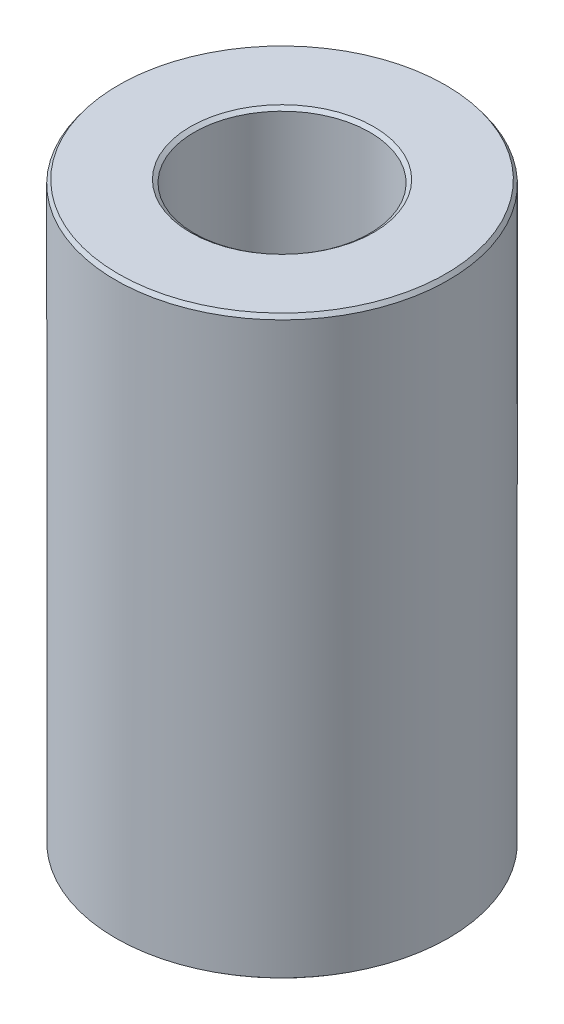
ISO-10303-21;
HEADER;
FILE_DESCRIPTION(('STEP AP214'),'2;1');
FILE_NAME('part.step','',(''),(''),'','','');
FILE_SCHEMA(('AUTOMOTIVE_DESIGN { 1 0 10303 214 1 1 1 1 }'));
ENDSEC;
DATA;
#1=APPLICATION_CONTEXT('core data for automotive mechanical design processes');
#2=APPLICATION_PROTOCOL_DEFINITION('international standard','automotive_design',2000,#1);
#3=PRODUCT_CONTEXT('',#1,'mechanical');
#4=PRODUCT('Part','Part','',(#3));
#5=PRODUCT_RELATED_PRODUCT_CATEGORY('part','',(#4));
#6=PRODUCT_DEFINITION_FORMATION('','',#4);
#7=PRODUCT_DEFINITION_CONTEXT('part definition',#1,'design');
#8=PRODUCT_DEFINITION('design','',#6,#7);
#9=PRODUCT_DEFINITION_SHAPE('','',#8);
#10=(LENGTH_UNIT() NAMED_UNIT(*) SI_UNIT(.MILLI.,.METRE.));
#11=(NAMED_UNIT(*) PLANE_ANGLE_UNIT() SI_UNIT($,.RADIAN.));
#12=(NAMED_UNIT(*) SI_UNIT($,.STERADIAN.) SOLID_ANGLE_UNIT());
#13=UNCERTAINTY_MEASURE_WITH_UNIT(LENGTH_MEASURE(1.E-05),#10,'distance_accuracy_value','');
#14=(GEOMETRIC_REPRESENTATION_CONTEXT(3) GLOBAL_UNCERTAINTY_ASSIGNED_CONTEXT((#13)) GLOBAL_UNIT_ASSIGNED_CONTEXT((#10,
#11,#12)) REPRESENTATION_CONTEXT('',''));
#15=CARTESIAN_POINT('',(0.,0.,0.));
#16=DIRECTION('',(0.,0.,1.));
#17=DIRECTION('',(1.,0.,0.));
#18=AXIS2_PLACEMENT_3D('',#15,#16,#17);
#19=CARTESIAN_POINT('',(0.,199.226242424922,0.));
#20=DIRECTION('',(0.,-1.,0.));
#21=DIRECTION('',(0.,0.,-1.));
#22=AXIS2_PLACEMENT_3D('',#19,#20,#21);
#23=CYLINDRICAL_SURFACE('',#22,57.5);
#24=CARTESIAN_POINT('',(0.,0.981950829890804,0.));
#25=DIRECTION('',(0.,1.,0.));
#26=DIRECTION('',(0.,0.,1.));
#27=AXIS2_PLACEMENT_3D('',#24,#25,#26);
#28=CIRCLE('',#27,57.5);
#29=CARTESIAN_POINT('',(0.,0.981950829890776,-57.5));
#30=VERTEX_POINT('',#29);
#31=EDGE_CURVE('E10',#30,#30,#28,.T.);
#32=CARTESIAN_POINT('',(0.,197.873534675724,0.));
#33=DIRECTION('',(0.,1.,0.));
#34=DIRECTION('',(0.,0.,1.));
#35=AXIS2_PLACEMENT_3D('',#32,#33,#34);
#36=CIRCLE('',#35,57.5);
#37=CARTESIAN_POINT('',(0.,197.873534675724,-57.5));
#38=VERTEX_POINT('',#37);
#39=EDGE_CURVE('E50',#38,#38,#36,.F.);
#40=CARTESIAN_POINT('',(0.,0.981950829890776,-57.5));
#41=CARTESIAN_POINT('',(0.,3.03290482828487,-57.5));
#42=CARTESIAN_POINT('',(0.,5.08385882667896,-57.5));
#43=CARTESIAN_POINT('',(0.,9.18576682346715,-57.5));
#44=CARTESIAN_POINT('',(0.,11.2367208218612,-57.5));
#45=CARTESIAN_POINT('',(0.,15.3386288186494,-57.5));
#46=CARTESIAN_POINT('',(0.,17.3895828170435,-57.5));
#47=CARTESIAN_POINT('',(0.,21.4914908138317,-57.5));
#48=CARTESIAN_POINT('',(0.,23.5424448122258,-57.5));
#49=CARTESIAN_POINT('',(0.,27.644352809014,-57.5));
#50=CARTESIAN_POINT('',(0.,29.6953068074081,-57.5));
#51=CARTESIAN_POINT('',(0.,33.7972148041962,-57.5));
#52=CARTESIAN_POINT('',(0.,35.8481688025903,-57.5));
#53=CARTESIAN_POINT('',(0.,39.9500767993785,-57.5));
#54=CARTESIAN_POINT('',(0.,42.0010307977726,-57.5));
#55=CARTESIAN_POINT('',(0.,46.1029387945608,-57.5));
#56=CARTESIAN_POINT('',(0.,48.1538927929549,-57.5));
#57=CARTESIAN_POINT('',(0.,52.255800789743,-57.5));
#58=CARTESIAN_POINT('',(0.,54.3067547881371,-57.5));
#59=CARTESIAN_POINT('',(0.,58.4086627849253,-57.5));
#60=CARTESIAN_POINT('',(0.,60.4596167833194,-57.5));
#61=CARTESIAN_POINT('',(0.,64.5615247801076,-57.5));
#62=CARTESIAN_POINT('',(0.,66.6124787785017,-57.5));
#63=CARTESIAN_POINT('',(0.,70.7143867752899,-57.5));
#64=CARTESIAN_POINT('',(0.,72.765340773684,-57.5));
#65=CARTESIAN_POINT('',(0.,76.8672487704721,-57.5));
#66=CARTESIAN_POINT('',(0.,78.9182027688662,-57.5));
#67=CARTESIAN_POINT('',(0.,83.0201107656544,-57.5));
#68=CARTESIAN_POINT('',(0.,85.0710647640485,-57.5));
#69=CARTESIAN_POINT('',(0.,89.1729727608367,-57.5));
#70=CARTESIAN_POINT('',(0.,91.2239267592308,-57.5));
#71=CARTESIAN_POINT('',(0.,95.325834756019,-57.5));
#72=CARTESIAN_POINT('',(0.,97.3767887544131,-57.5));
#73=CARTESIAN_POINT('',(0.,101.478696751201,-57.5));
#74=CARTESIAN_POINT('',(0.,103.529650749595,-57.5));
#75=CARTESIAN_POINT('',(0.,107.631558746384,-57.5));
#76=CARTESIAN_POINT('',(0.,109.682512744778,-57.5));
#77=CARTESIAN_POINT('',(0.,113.784420741566,-57.5));
#78=CARTESIAN_POINT('',(0.,115.83537473996,-57.5));
#79=CARTESIAN_POINT('',(0.,119.937282736748,-57.5));
#80=CARTESIAN_POINT('',(0.,121.988236735142,-57.5));
#81=CARTESIAN_POINT('',(0.,126.09014473193,-57.5));
#82=CARTESIAN_POINT('',(0.,128.141098730324,-57.5));
#83=CARTESIAN_POINT('',(0.,132.243006727113,-57.5));
#84=CARTESIAN_POINT('',(0.,134.293960725507,-57.5));
#85=CARTESIAN_POINT('',(0.,138.395868722295,-57.5));
#86=CARTESIAN_POINT('',(0.,140.446822720689,-57.5));
#87=CARTESIAN_POINT('',(0.,144.548730717477,-57.5));
#88=CARTESIAN_POINT('',(0.,146.599684715871,-57.5));
#89=CARTESIAN_POINT('',(0.,150.701592712659,-57.5));
#90=CARTESIAN_POINT('',(0.,152.752546711053,-57.5));
#91=CARTESIAN_POINT('',(0.,156.854454707842,-57.5));
#92=CARTESIAN_POINT('',(0.,158.905408706236,-57.5));
#93=CARTESIAN_POINT('',(0.,163.007316703024,-57.5));
#94=CARTESIAN_POINT('',(0.,165.058270701418,-57.5));
#95=CARTESIAN_POINT('',(0.,169.160178698206,-57.5));
#96=CARTESIAN_POINT('',(0.,171.2111326966,-57.5));
#97=CARTESIAN_POINT('',(0.,175.313040693389,-57.5));
#98=CARTESIAN_POINT('',(0.,177.363994691783,-57.5));
#99=CARTESIAN_POINT('',(0.,181.465902688571,-57.5));
#100=CARTESIAN_POINT('',(0.,183.516856686965,-57.5));
#101=CARTESIAN_POINT('',(0.,187.618764683753,-57.5));
#102=CARTESIAN_POINT('',(0.,189.669718682147,-57.5));
#103=CARTESIAN_POINT('',(0.,193.771626678935,-57.5));
#104=CARTESIAN_POINT('',(0.,195.822580677329,-57.5));
#105=CARTESIAN_POINT('',(0.,197.873534675724,-57.5));
#106=B_SPLINE_CURVE_WITH_KNOTS('',3,(#40,#41,#42,#43,#44,#45,#46,#47,#48,#49,#50,#51,#52,#53,
#54,#55,#56,#57,#58,#59,#60,#61,#62,#63,#64,#65,#66,#67,#68,#69,#70,#71,#72,#73,#74,#75,#76,#77,
#78,#79,#80,#81,#82,#83,#84,#85,#86,#87,#88,#89,#90,#91,#92,#93,#94,#95,#96,#97,#98,#99,#100,
#101,#102,#103,#104,#105),.UNSPECIFIED.,.F.,.F.,(4,2,2,2,2,2,2,2,2,2,2,2,2,2,2,2,2,2,2,2,2,2,2,
2,2,2,2,2,2,2,2,2,4),(0.,6.15286199518228,12.3057239903646,18.4585859855468,24.6114479807291,
30.7643099759114,36.9171719710937,43.0700339662759,49.2228959614582,55.3757579566405,
61.5286199518227,67.681481947005,73.8343439421873,79.9872059373696,86.1400679325518,
92.2929299277341,98.4457919229164,104.598653918099,110.751515913281,116.904377908463,
123.057239903645,129.210101898828,135.36296389401,141.515825889192,147.668687884375,
153.821549879557,159.974411874739,166.127273869921,172.280135865104,178.432997860286,
184.585859855468,190.73872185065,196.891583845833),.UNSPECIFIED.);
#107=EDGE_CURVE('BSEAM39',#30,#38,#106,.T.);
#108=ORIENTED_EDGE('',*,*,#31,.T.);
#109=ORIENTED_EDGE('',*,*,#39,.T.);
#110=ORIENTED_EDGE('',*,*,#107,.T.);
#111=ORIENTED_EDGE('',*,*,#107,.F.);
#112=EDGE_LOOP('',(#108,#110,#109,#111));
#113=FACE_BOUND('',#112,.T.);
#114=ADVANCED_FACE('F39',(#113),#23,.T.);
#115=CARTESIAN_POINT('',(0.,199.226242424922,0.));
#116=DIRECTION('',(0.,1.,0.));
#117=DIRECTION('',(0.,0.,1.));
#118=AXIS2_PLACEMENT_3D('',#115,#116,#117);
#119=PLANE('',#118);
#120=CARTESIAN_POINT('',(0.,199.226242424922,0.));
#121=DIRECTION('',(0.,1.,0.));
#122=DIRECTION('',(0.,0.,1.));
#123=AXIS2_PLACEMENT_3D('',#120,#121,#122);
#124=CIRCLE('',#123,31.6689242398001);
#125=CARTESIAN_POINT('',(0.,199.226242424922,31.6689242398001));
#126=VERTEX_POINT('',#125);
#127=EDGE_CURVE('E58',#126,#126,#124,.F.);
#128=ORIENTED_EDGE('',*,*,#127,.T.);
#129=EDGE_LOOP('',(#128));
#130=FACE_BOUND('',#129,.T.);
#131=CARTESIAN_POINT('',(0.,199.226242424922,0.));
#132=DIRECTION('',(0.,1.,0.));
#133=DIRECTION('',(0.,0.,1.));
#134=AXIS2_PLACEMENT_3D('',#131,#132,#133);
#135=CIRCLE('',#134,56.5180491701095);
#136=CARTESIAN_POINT('',(0.,199.226242424922,-56.5180491701095));
#137=VERTEX_POINT('',#136);
#138=EDGE_CURVE('E61',#137,#137,#135,.T.);
#139=ORIENTED_EDGE('',*,*,#138,.T.);
#140=EDGE_LOOP('',(#139));
#141=FACE_BOUND('',#140,.T.);
#142=ADVANCED_FACE('F88',(#130,#141),#119,.T.);
#143=CARTESIAN_POINT('',(0.,0.,0.));
#144=DIRECTION('',(0.,1.,0.));
#145=DIRECTION('',(0.,0.,1.));
#146=AXIS2_PLACEMENT_3D('',#143,#144,#145);
#147=PLANE('',#146);
#148=CARTESIAN_POINT('',(0.,0.,0.));
#149=DIRECTION('',(0.,1.,0.));
#150=DIRECTION('',(0.,0.,1.));
#151=AXIS2_PLACEMENT_3D('',#148,#149,#150);
#152=CIRCLE('',#151,31.2981673204917);
#153=CARTESIAN_POINT('',(0.,0.,31.2981673204917));
#154=VERTEX_POINT('',#153);
#155=EDGE_CURVE('E51',#154,#154,#152,.T.);
#156=ORIENTED_EDGE('',*,*,#155,.T.);
#157=EDGE_LOOP('',(#156));
#158=FACE_BOUND('',#157,.T.);
#159=CARTESIAN_POINT('',(0.,0.,0.));
#160=DIRECTION('',(0.,1.,0.));
#161=DIRECTION('',(0.,0.,1.));
#162=AXIS2_PLACEMENT_3D('',#159,#160,#161);
#163=CIRCLE('',#162,56.1472922508011);
#164=CARTESIAN_POINT('',(0.,0.,56.1472922508011));
#165=VERTEX_POINT('',#164);
#166=EDGE_CURVE('E54',#165,#165,#163,.F.);
#167=ORIENTED_EDGE('',*,*,#166,.T.);
#168=EDGE_LOOP('',(#167));
#169=FACE_BOUND('',#168,.T.);
#170=ADVANCED_FACE('F83',(#158,#169),#147,.F.);
#171=CARTESIAN_POINT('',(0.,199.226242424922,0.));
#172=DIRECTION('',(0.,-1.,0.));
#173=DIRECTION('',(0.,0.,-1.));
#174=AXIS2_PLACEMENT_3D('',#171,#172,#173);
#175=CYLINDRICAL_SURFACE('',#174,30.3162164906011);
#176=CARTESIAN_POINT('',(0.,198.244291595031,0.));
#177=DIRECTION('',(0.,1.,0.));
#178=DIRECTION('',(0.,0.,1.));
#179=AXIS2_PLACEMENT_3D('',#176,#177,#178);
#180=CIRCLE('',#179,30.3162164906011);
#181=CARTESIAN_POINT('',(0.,198.244291595031,-30.3162164906011));
#182=VERTEX_POINT('',#181);
#183=EDGE_CURVE('E67',#182,#182,#180,.T.);
#184=CARTESIAN_POINT('',(0.,1.35270774919871,0.));
#185=DIRECTION('',(0.,1.,0.));
#186=DIRECTION('',(0.,0.,1.));
#187=AXIS2_PLACEMENT_3D('',#184,#185,#186);
#188=CIRCLE('',#187,30.3162164906011);
#189=CARTESIAN_POINT('',(0.,1.35270774919871,-30.3162164906011));
#190=VERTEX_POINT('',#189);
#191=EDGE_CURVE('E69',#190,#190,#188,.F.);
#192=CARTESIAN_POINT('',(0.,198.244291595031,-30.3162164906011));
#193=CARTESIAN_POINT('',(0.,196.193337596637,-30.3162164906011));
#194=CARTESIAN_POINT('',(0.,194.142383598243,-30.3162164906011));
#195=CARTESIAN_POINT('',(0.,190.040475601455,-30.3162164906011));
#196=CARTESIAN_POINT('',(0.,187.989521603061,-30.3162164906011));
#197=CARTESIAN_POINT('',(0.,183.887613606273,-30.3162164906011));
#198=CARTESIAN_POINT('',(0.,181.836659607879,-30.3162164906011));
#199=CARTESIAN_POINT('',(0.,177.73475161109,-30.3162164906011));
#200=CARTESIAN_POINT('',(0.,175.683797612696,-30.3162164906011));
#201=CARTESIAN_POINT('',(0.,171.581889615908,-30.3162164906011));
#202=CARTESIAN_POINT('',(0.,169.530935617514,-30.3162164906011));
#203=CARTESIAN_POINT('',(0.,165.429027620726,-30.3162164906011));
#204=CARTESIAN_POINT('',(0.,163.378073622332,-30.3162164906011));
#205=CARTESIAN_POINT('',(0.,159.276165625544,-30.3162164906011));
#206=CARTESIAN_POINT('',(0.,157.225211627149,-30.3162164906011));
#207=CARTESIAN_POINT('',(0.,153.123303630361,-30.3162164906011));
#208=CARTESIAN_POINT('',(0.,151.072349631967,-30.3162164906011));
#209=CARTESIAN_POINT('',(0.,146.970441635179,-30.3162164906011));
#210=CARTESIAN_POINT('',(0.,144.919487636785,-30.3162164906011));
#211=CARTESIAN_POINT('',(0.,140.817579639997,-30.3162164906011));
#212=CARTESIAN_POINT('',(0.,138.766625641603,-30.3162164906011));
#213=CARTESIAN_POINT('',(0.,134.664717644814,-30.3162164906011));
#214=CARTESIAN_POINT('',(0.,132.61376364642,-30.3162164906011));
#215=CARTESIAN_POINT('',(0.,128.511855649632,-30.3162164906011));
#216=CARTESIAN_POINT('',(0.,126.460901651238,-30.3162164906011));
#217=CARTESIAN_POINT('',(0.,122.35899365445,-30.3162164906011));
#218=CARTESIAN_POINT('',(0.,120.308039656056,-30.3162164906011));
#219=CARTESIAN_POINT('',(0.,116.206131659268,-30.3162164906011));
#220=CARTESIAN_POINT('',(0.,114.155177660874,-30.3162164906011));
#221=CARTESIAN_POINT('',(0.,110.053269664085,-30.3162164906011));
#222=CARTESIAN_POINT('',(0.,108.002315665691,-30.3162164906011));
#223=CARTESIAN_POINT('',(0.,103.900407668903,-30.3162164906011));
#224=CARTESIAN_POINT('',(0.,101.849453670509,-30.3162164906011));
#225=CARTESIAN_POINT('',(0.,97.7475456737209,-30.3162164906011));
#226=CARTESIAN_POINT('',(0.,95.6965916753268,-30.3162164906011));
#227=CARTESIAN_POINT('',(0.,91.5946836785386,-30.3162164906011));
#228=CARTESIAN_POINT('',(0.,89.5437296801445,-30.3162164906011));
#229=CARTESIAN_POINT('',(0.,85.4418216833564,-30.3162164906011));
#230=CARTESIAN_POINT('',(0.,83.3908676849623,-30.3162164906011));
#231=CARTESIAN_POINT('',(0.,79.2889596881741,-30.3162164906011));
#232=CARTESIAN_POINT('',(0.,77.23800568978,-30.3162164906011));
#233=CARTESIAN_POINT('',(0.,73.1360976929918,-30.3162164906011));
#234=CARTESIAN_POINT('',(0.,71.0851436945977,-30.3162164906011));
#235=CARTESIAN_POINT('',(0.,66.9832356978096,-30.3162164906011));
#236=CARTESIAN_POINT('',(0.,64.9322816994155,-30.3162164906011));
#237=CARTESIAN_POINT('',(0.,60.8303737026273,-30.3162164906011));
#238=CARTESIAN_POINT('',(0.,58.7794197042332,-30.3162164906011));
#239=CARTESIAN_POINT('',(0.,54.677511707445,-30.3162164906011));
#240=CARTESIAN_POINT('',(0.,52.6265577090509,-30.3162164906011));
#241=CARTESIAN_POINT('',(0.,48.5246497122628,-30.3162164906011));
#242=CARTESIAN_POINT('',(0.,46.4736957138687,-30.3162164906011));
#243=CARTESIAN_POINT('',(0.,42.3717877170805,-30.3162164906011));
#244=CARTESIAN_POINT('',(0.,40.3208337186864,-30.3162164906011));
#245=CARTESIAN_POINT('',(0.,36.2189257218982,-30.3162164906011));
#246=CARTESIAN_POINT('',(0.,34.1679717235041,-30.3162164906011));
#247=CARTESIAN_POINT('',(0.,30.066063726716,-30.3162164906011));
#248=CARTESIAN_POINT('',(0.,28.0151097283219,-30.3162164906011));
#249=CARTESIAN_POINT('',(0.,23.9132017315337,-30.3162164906011));
#250=CARTESIAN_POINT('',(0.,21.8622477331396,-30.3162164906011));
#251=CARTESIAN_POINT('',(0.,17.7603397363514,-30.3162164906011));
#252=CARTESIAN_POINT('',(0.,15.7093857379573,-30.3162164906011));
#253=CARTESIAN_POINT('',(0.,11.6074777411692,-30.3162164906011));
#254=CARTESIAN_POINT('',(0.,9.55652374277508,-30.3162164906011));
#255=CARTESIAN_POINT('',(0.,5.4546157459869,-30.3162164906011));
#256=CARTESIAN_POINT('',(0.,3.40366174759281,-30.3162164906011));
#257=CARTESIAN_POINT('',(0.,1.35270774919871,-30.3162164906011));
#258=B_SPLINE_CURVE_WITH_KNOTS('',3,(#192,#193,#194,#195,#196,#197,#198,#199,#200,#201,#202,
#203,#204,#205,#206,#207,#208,#209,#210,#211,#212,#213,#214,#215,#216,#217,#218,#219,#220,#221,
#222,#223,#224,#225,#226,#227,#228,#229,#230,#231,#232,#233,#234,#235,#236,#237,#238,#239,#240,
#241,#242,#243,#244,#245,#246,#247,#248,#249,#250,#251,#252,#253,#254,#255,#256,#257),
.UNSPECIFIED.,.F.,.F.,(4,2,2,2,2,2,2,2,2,2,2,2,2,2,2,2,2,2,2,2,2,2,2,2,2,2,2,2,2,2,2,2,4),(0.,
6.15286199518225,12.3057239903645,18.4585859855468,24.6114479807291,30.7643099759113,
36.9171719710936,43.0700339662758,49.2228959614581,55.3757579566404,61.5286199518227,
67.6814819470049,73.8343439421872,79.9872059373695,86.1400679325517,92.292929927734,
98.4457919229162,104.598653918099,110.751515913281,116.904377908463,123.057239903645,
129.210101898828,135.36296389401,141.515825889192,147.668687884374,153.821549879557,
159.974411874739,166.127273869921,172.280135865103,178.432997860286,184.585859855468,
190.73872185065,196.891583845833),.UNSPECIFIED.);
#259=EDGE_CURVE('BSEAM71',#182,#190,#258,.T.);
#260=ORIENTED_EDGE('',*,*,#183,.T.);
#261=ORIENTED_EDGE('',*,*,#191,.T.);
#262=ORIENTED_EDGE('',*,*,#259,.T.);
#263=ORIENTED_EDGE('',*,*,#259,.F.);
#264=EDGE_LOOP('',(#260,#262,#261,#263));
#265=FACE_BOUND('',#264,.T.);
#266=ADVANCED_FACE('F71',(#265),#175,.F.);
#267=CARTESIAN_POINT('',(0.,198.244291595031,0.));
#268=DIRECTION('',(0.,1.,0.));
#269=DIRECTION('',(0.,0.,1.));
#270=AXIS2_PLACEMENT_3D('',#267,#268,#269);
#271=CONICAL_SURFACE('',#270,30.3162164906011,0.942888648747506);
#272=ORIENTED_EDGE('',*,*,#127,.F.);
#273=EDGE_LOOP('',(#272));
#274=FACE_BOUND('',#273,.T.);
#275=ORIENTED_EDGE('',*,*,#183,.F.);
#276=EDGE_LOOP('',(#275));
#277=FACE_BOUND('',#276,.T.);
#278=ADVANCED_FACE('F77',(#274,#277),#271,.F.);
#279=CARTESIAN_POINT('',(0.,0.,0.));
#280=DIRECTION('',(0.,-1.,0.));
#281=DIRECTION('',(0.,0.,-1.));
#282=AXIS2_PLACEMENT_3D('',#279,#280,#281);
#283=CONICAL_SURFACE('',#282,31.2981673204917,0.6279076780474);
#284=ORIENTED_EDGE('',*,*,#191,.F.);
#285=EDGE_LOOP('',(#284));
#286=FACE_BOUND('',#285,.T.);
#287=ORIENTED_EDGE('',*,*,#155,.F.);
#288=EDGE_LOOP('',(#287));
#289=FACE_BOUND('',#288,.T.);
#290=ADVANCED_FACE('F73',(#286,#289),#283,.F.);
#291=CARTESIAN_POINT('',(0.,0.981950829890804,0.));
#292=DIRECTION('',(0.,1.,0.));
#293=DIRECTION('',(0.,0.,1.));
#294=AXIS2_PLACEMENT_3D('',#291,#292,#293);
#295=CONICAL_SURFACE('',#294,57.5,0.942888648747489);
#296=ORIENTED_EDGE('',*,*,#166,.F.);
#297=EDGE_LOOP('',(#296));
#298=FACE_BOUND('',#297,.T.);
#299=ORIENTED_EDGE('',*,*,#31,.F.);
#300=EDGE_LOOP('',(#299));
#301=FACE_BOUND('',#300,.T.);
#302=ADVANCED_FACE('F76',(#298,#301),#295,.T.);
#303=CARTESIAN_POINT('',(0.,199.226242424922,0.));
#304=DIRECTION('',(0.,-1.,0.));
#305=DIRECTION('',(0.,0.,-1.));
#306=AXIS2_PLACEMENT_3D('',#303,#304,#305);
#307=CONICAL_SURFACE('',#306,56.5180491701095,0.627907678047398);
#308=CARTESIAN_POINT('',(0.,197.873534675724,-57.5));
#309=CARTESIAN_POINT('',(0.,197.887625381444,-57.489771345522));
#310=CARTESIAN_POINT('',(0.,197.901716087165,-57.479542691044));
#311=CARTESIAN_POINT('',(0.,197.929897498607,-57.4590853820879));
#312=CARTESIAN_POINT('',(0.,197.943988204328,-57.4488567276099));
#313=CARTESIAN_POINT('',(0.,197.972169615769,-57.4283994186538));
#314=CARTESIAN_POINT('',(0.,197.98626032149,-57.4181707641758));
#315=CARTESIAN_POINT('',(0.,198.014441732932,-57.3977134552198));
#316=CARTESIAN_POINT('',(0.,198.028532438653,-57.3874848007417));
#317=CARTESIAN_POINT('',(0.,198.056713850094,-57.3670274917857));
#318=CARTESIAN_POINT('',(0.,198.070804555815,-57.3567988373077));
#319=CARTESIAN_POINT('',(0.,198.098985967257,-57.3363415283516));
#320=CARTESIAN_POINT('',(0.,198.113076672977,-57.3261128738736));
#321=CARTESIAN_POINT('',(0.,198.141258084419,-57.3056555649175));
#322=CARTESIAN_POINT('',(0.,198.15534879014,-57.2954269104395));
#323=CARTESIAN_POINT('',(0.,198.183530201582,-57.2749696014834));
#324=CARTESIAN_POINT('',(0.,198.197620907302,-57.2647409470054));
#325=CARTESIAN_POINT('',(0.,198.225802318744,-57.2442836380494));
#326=CARTESIAN_POINT('',(0.,198.239893024465,-57.2340549835713));
#327=CARTESIAN_POINT('',(0.,198.268074435906,-57.2135976746153));
#328=CARTESIAN_POINT('',(0.,198.282165141627,-57.2033690201373));
#329=CARTESIAN_POINT('',(0.,198.310346553069,-57.1829117111812));
#330=CARTESIAN_POINT('',(0.,198.32443725879,-57.1726830567032));
#331=CARTESIAN_POINT('',(0.,198.352618670231,-57.1522257477471));
#332=CARTESIAN_POINT('',(0.,198.366709375952,-57.1419970932691));
#333=CARTESIAN_POINT('',(0.,198.394890787394,-57.1215397843131));
#334=CARTESIAN_POINT('',(0.,198.408981493115,-57.111311129835));
#335=CARTESIAN_POINT('',(0.,198.437162904556,-57.090853820879));
#336=CARTESIAN_POINT('',(0.,198.451253610277,-57.0806251664009));
#337=CARTESIAN_POINT('',(0.,198.479435021719,-57.0601678574449));
#338=CARTESIAN_POINT('',(0.,198.49352572744,-57.0499392029669));
#339=CARTESIAN_POINT('',(0.,198.521707138881,-57.0294818940108));
#340=CARTESIAN_POINT('',(0.,198.535797844602,-57.0192532395328));
#341=CARTESIAN_POINT('',(0.,198.563979256044,-56.9987959305767));
#342=CARTESIAN_POINT('',(0.,198.578069961764,-56.9885672760987));
#343=CARTESIAN_POINT('',(0.,198.606251373206,-56.9681099671427));
#344=CARTESIAN_POINT('',(0.,198.620342078927,-56.9578813126646));
#345=CARTESIAN_POINT('',(0.,198.648523490368,-56.9374240037086));
#346=CARTESIAN_POINT('',(0.,198.662614196089,-56.9271953492306));
#347=CARTESIAN_POINT('',(0.,198.690795607531,-56.9067380402745));
#348=CARTESIAN_POINT('',(0.,198.704886313252,-56.8965093857965));
#349=CARTESIAN_POINT('',(0.,198.733067724693,-56.8760520768404));
#350=CARTESIAN_POINT('',(0.,198.747158430414,-56.8658234223624));
#351=CARTESIAN_POINT('',(0.,198.775339841856,-56.8453661134063));
#352=CARTESIAN_POINT('',(0.,198.789430547577,-56.8351374589283));
#353=CARTESIAN_POINT('',(0.,198.817611959018,-56.8146801499723));
#354=CARTESIAN_POINT('',(0.,198.831702664739,-56.8044514954942));
#355=CARTESIAN_POINT('',(0.,198.859884076181,-56.7839941865382));
#356=CARTESIAN_POINT('',(0.,198.873974781902,-56.7737655320602));
#357=CARTESIAN_POINT('',(0.,198.902156193343,-56.7533082231041));
#358=CARTESIAN_POINT('',(0.,198.916246899064,-56.7430795686261));
#359=CARTESIAN_POINT('',(0.,198.944428310506,-56.72262225967));
#360=CARTESIAN_POINT('',(0.,198.958519016227,-56.712393605192));
#361=CARTESIAN_POINT('',(0.,198.986700427668,-56.691936296236));
#362=CARTESIAN_POINT('',(0.,199.000791133389,-56.6817076417579));
#363=CARTESIAN_POINT('',(0.,199.028972544831,-56.6612503328019));
#364=CARTESIAN_POINT('',(0.,199.043063250551,-56.6510216783239));
#365=CARTESIAN_POINT('',(0.,199.071244661993,-56.6305643693678));
#366=CARTESIAN_POINT('',(0.,199.085335367714,-56.6203357148898));
#367=CARTESIAN_POINT('',(0.,199.113516779156,-56.5998784059337));
#368=CARTESIAN_POINT('',(0.,199.127607484876,-56.5896497514557));
#369=CARTESIAN_POINT('',(0.,199.155788896318,-56.5691924424996));
#370=CARTESIAN_POINT('',(0.,199.169879602039,-56.5589637880216));
#371=CARTESIAN_POINT('',(0.,199.19806101348,-56.5385064790656));
#372=CARTESIAN_POINT('',(0.,199.212151719201,-56.5282778245875));
#373=CARTESIAN_POINT('',(0.,199.226242424922,-56.5180491701095));
#374=B_SPLINE_CURVE_WITH_KNOTS('',3,(#308,#309,#310,#311,#312,#313,#314,#315,#316,#317,#318,
#319,#320,#321,#322,#323,#324,#325,#326,#327,#328,#329,#330,#331,#332,#333,#334,#335,#336,#337,
#338,#339,#340,#341,#342,#343,#344,#345,#346,#347,#348,#349,#350,#351,#352,#353,#354,#355,#356,
#357,#358,#359,#360,#361,#362,#363,#364,#365,#366,#367,#368,#369,#370,#371,#372,#373),
.UNSPECIFIED.,.F.,.F.,(4,2,2,2,2,2,2,2,2,2,2,2,2,2,2,2,2,2,2,2,2,2,2,2,2,2,2,2,2,2,2,2,4),(0.,
0.052235622340235,0.104471244680488,0.156706867020746,0.208942489361003,0.261178111701261,
0.313413734041518,0.365649356381776,0.417884978722033,0.470120601062291,0.522356223402548,
0.574591845742806,0.626827468083063,0.679063090423321,0.731298712763578,0.783534335103836,
0.835769957444094,0.888005579784329,0.940241202124586,0.992476824464844,1.0447124468051,
1.09694806914536,1.14918369148562,1.20141931382587,1.25365493616613,1.30589055850639,
1.35812618084665,1.4103618031869,1.46259742552716,1.51483304786742,1.56706867020768,
1.61930429254793,1.67153991488819),.UNSPECIFIED.);
#375=EDGE_CURVE('BSEAM45',#38,#137,#374,.T.);
#376=ORIENTED_EDGE('',*,*,#39,.F.);
#377=ORIENTED_EDGE('',*,*,#138,.F.);
#378=ORIENTED_EDGE('',*,*,#375,.T.);
#379=ORIENTED_EDGE('',*,*,#375,.F.);
#380=EDGE_LOOP('',(#376,#378,#377,#379));
#381=FACE_BOUND('',#380,.T.);
#382=ADVANCED_FACE('F45',(#381),#307,.T.);
#383=CLOSED_SHELL('',(#114,#142,#170,#266,#278,#290,#302,#382));
#384=MANIFOLD_SOLID_BREP('B2',#383);
#385=ADVANCED_BREP_SHAPE_REPRESENTATION('',(#18,#384),#14);
#386=SHAPE_DEFINITION_REPRESENTATION(#9,#385);
ENDSEC;
END-ISO-10303-21;
